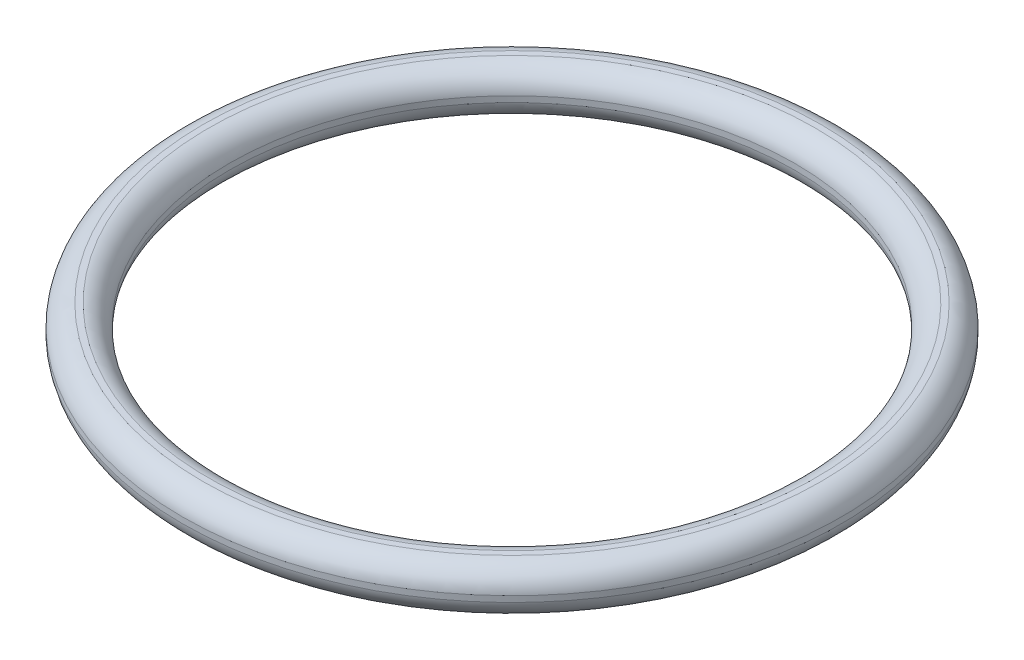
ISO-10303-21;
HEADER;
FILE_DESCRIPTION(('STEP AP214'),'2;1');
FILE_NAME('part.step','',(''),(''),'','','');
FILE_SCHEMA(('AUTOMOTIVE_DESIGN { 1 0 10303 214 1 1 1 1 }'));
ENDSEC;
DATA;
#1=APPLICATION_CONTEXT('core data for automotive mechanical design processes');
#2=APPLICATION_PROTOCOL_DEFINITION('international standard','automotive_design',2000,#1);
#3=PRODUCT_CONTEXT('',#1,'mechanical');
#4=PRODUCT('Part','Part','',(#3));
#5=PRODUCT_RELATED_PRODUCT_CATEGORY('part','',(#4));
#6=PRODUCT_DEFINITION_FORMATION('','',#4);
#7=PRODUCT_DEFINITION_CONTEXT('part definition',#1,'design');
#8=PRODUCT_DEFINITION('design','',#6,#7);
#9=PRODUCT_DEFINITION_SHAPE('','',#8);
#10=(LENGTH_UNIT() NAMED_UNIT(*) SI_UNIT(.MILLI.,.METRE.));
#11=(NAMED_UNIT(*) PLANE_ANGLE_UNIT() SI_UNIT($,.RADIAN.));
#12=(NAMED_UNIT(*) SI_UNIT($,.STERADIAN.) SOLID_ANGLE_UNIT());
#13=UNCERTAINTY_MEASURE_WITH_UNIT(LENGTH_MEASURE(1.E-05),#10,'distance_accuracy_value','');
#14=(GEOMETRIC_REPRESENTATION_CONTEXT(3) GLOBAL_UNCERTAINTY_ASSIGNED_CONTEXT((#13)) GLOBAL_UNIT_ASSIGNED_CONTEXT((#10,
#11,#12)) REPRESENTATION_CONTEXT('',''));
#15=CARTESIAN_POINT('',(0.,0.,0.));
#16=DIRECTION('',(0.,0.,1.));
#17=DIRECTION('',(1.,0.,0.));
#18=AXIS2_PLACEMENT_3D('',#15,#16,#17);
#19=CARTESIAN_POINT('',(0.,0.,0.));
#20=DIRECTION('',(0.,-1.,0.));
#21=DIRECTION('',(0.,0.,-1.));
#22=AXIS2_PLACEMENT_3D('',#19,#20,#21);
#23=TOROIDAL_SURFACE('',#22,41.275,3.175);
#24=CARTESIAN_POINT('',(0.,-3.15000000000001,0.));
#25=DIRECTION('',(0.,1.,0.));
#26=DIRECTION('',(0.,0.,1.));
#27=AXIS2_PLACEMENT_3D('',#24,#25,#26);
#28=CIRCLE('',#27,40.8773506569853);
#29=CARTESIAN_POINT('',(0.,-3.15000000000001,40.8773506569853));
#30=VERTEX_POINT('',#29);
#31=EDGE_CURVE('E50',#30,#30,#28,.T.);
#32=ORIENTED_EDGE('',*,*,#31,.F.);
#33=EDGE_LOOP('',(#32));
#34=FACE_BOUND('',#33,.T.);
#35=CARTESIAN_POINT('',(0.,-0.397649343014659,0.));
#36=DIRECTION('',(0.,1.,0.));
#37=DIRECTION('',(0.,0.,1.));
#38=AXIS2_PLACEMENT_3D('',#35,#36,#37);
#39=CIRCLE('',#38,38.125);
#40=CARTESIAN_POINT('',(0.,-0.397649343014659,38.125));
#41=VERTEX_POINT('',#40);
#42=EDGE_CURVE('E46',#41,#41,#39,.F.);
#43=ORIENTED_EDGE('',*,*,#42,.F.);
#44=EDGE_LOOP('',(#43));
#45=FACE_BOUND('',#44,.T.);
#46=ADVANCED_FACE('F42',(#34,#45),#23,.T.);
#47=CARTESIAN_POINT('',(0.,3.15,0.));
#48=DIRECTION('',(0.,-1.,0.));
#49=DIRECTION('',(0.,0.,-1.));
#50=AXIS2_PLACEMENT_3D('',#47,#48,#49);
#51=CIRCLE('',#50,40.8773506569853);
#52=CARTESIAN_POINT('',(0.,3.15,-40.8773506569853));
#53=VERTEX_POINT('',#52);
#54=EDGE_CURVE('E64',#53,#53,#51,.T.);
#55=ORIENTED_EDGE('',*,*,#54,.F.);
#56=EDGE_LOOP('',(#55));
#57=FACE_BOUND('',#56,.T.);
#58=CARTESIAN_POINT('',(0.,0.397649343014649,0.));
#59=DIRECTION('',(0.,-1.,0.));
#60=DIRECTION('',(0.,0.,-1.));
#61=AXIS2_PLACEMENT_3D('',#58,#59,#60);
#62=CIRCLE('',#61,38.125);
#63=CARTESIAN_POINT('',(0.,0.397649343014649,-38.125));
#64=VERTEX_POINT('',#63);
#65=EDGE_CURVE('E65',#64,#64,#62,.F.);
#66=ORIENTED_EDGE('',*,*,#65,.F.);
#67=EDGE_LOOP('',(#66));
#68=FACE_BOUND('',#67,.T.);
#69=ADVANCED_FACE('F75',(#57,#68),#23,.T.);
#70=CARTESIAN_POINT('',(0.,-0.397649343014659,0.));
#71=DIRECTION('',(0.,1.,0.));
#72=DIRECTION('',(0.,0.,1.));
#73=AXIS2_PLACEMENT_3D('',#70,#71,#72);
#74=CIRCLE('',#73,44.425);
#75=CARTESIAN_POINT('',(0.,-0.397649343014659,44.425));
#76=VERTEX_POINT('',#75);
#77=EDGE_CURVE('E62',#76,#76,#74,.F.);
#78=ORIENTED_EDGE('',*,*,#77,.T.);
#79=EDGE_LOOP('',(#78));
#80=FACE_BOUND('',#79,.T.);
#81=CARTESIAN_POINT('',(0.,-3.15000000000001,0.));
#82=DIRECTION('',(0.,-1.,0.));
#83=DIRECTION('',(0.,0.,-1.));
#84=AXIS2_PLACEMENT_3D('',#81,#82,#83);
#85=CIRCLE('',#84,41.6726493430146);
#86=CARTESIAN_POINT('',(0.,-3.15000000000001,-41.6726493430146));
#87=VERTEX_POINT('',#86);
#88=EDGE_CURVE('E10',#87,#87,#85,.T.);
#89=ORIENTED_EDGE('',*,*,#88,.F.);
#90=EDGE_LOOP('',(#89));
#91=FACE_BOUND('',#90,.T.);
#92=ADVANCED_FACE('F80',(#80,#91),#23,.T.);
#93=CARTESIAN_POINT('',(0.,3.15,0.));
#94=DIRECTION('',(0.,1.,0.));
#95=DIRECTION('',(0.,0.,1.));
#96=AXIS2_PLACEMENT_3D('',#93,#94,#95);
#97=PLANE('',#96);
#98=ORIENTED_EDGE('',*,*,#54,.T.);
#99=EDGE_LOOP('',(#98));
#100=FACE_BOUND('',#99,.T.);
#101=CARTESIAN_POINT('',(0.,3.15,0.));
#102=DIRECTION('',(0.,1.,0.));
#103=DIRECTION('',(0.,0.,1.));
#104=AXIS2_PLACEMENT_3D('',#101,#102,#103);
#105=CIRCLE('',#104,41.6726493430146);
#106=CARTESIAN_POINT('',(0.,3.15,41.6726493430146));
#107=VERTEX_POINT('',#106);
#108=EDGE_CURVE('E55',#107,#107,#105,.T.);
#109=ORIENTED_EDGE('',*,*,#108,.T.);
#110=EDGE_LOOP('',(#109));
#111=FACE_BOUND('',#110,.T.);
#112=ADVANCED_FACE('F85',(#100,#111),#97,.T.);
#113=CARTESIAN_POINT('',(0.,0.397649343014649,0.));
#114=DIRECTION('',(0.,-1.,0.));
#115=DIRECTION('',(0.,0.,-1.));
#116=AXIS2_PLACEMENT_3D('',#113,#114,#115);
#117=CIRCLE('',#116,44.425);
#118=CARTESIAN_POINT('',(0.,0.397649343014649,-44.425));
#119=VERTEX_POINT('',#118);
#120=EDGE_CURVE('E59',#119,#119,#117,.F.);
#121=ORIENTED_EDGE('',*,*,#120,.T.);
#122=EDGE_LOOP('',(#121));
#123=FACE_BOUND('',#122,.T.);
#124=ORIENTED_EDGE('',*,*,#108,.F.);
#125=EDGE_LOOP('',(#124));
#126=FACE_BOUND('',#125,.T.);
#127=ADVANCED_FACE('F44',(#123,#126),#23,.T.);
#128=CARTESIAN_POINT('',(0.,-3.15000000000001,0.));
#129=DIRECTION('',(0.,-1.,0.));
#130=DIRECTION('',(0.,0.,-1.));
#131=AXIS2_PLACEMENT_3D('',#128,#129,#130);
#132=PLANE('',#131);
#133=ORIENTED_EDGE('',*,*,#31,.T.);
#134=EDGE_LOOP('',(#133));
#135=FACE_BOUND('',#134,.T.);
#136=ORIENTED_EDGE('',*,*,#88,.T.);
#137=EDGE_LOOP('',(#136));
#138=FACE_BOUND('',#137,.T.);
#139=ADVANCED_FACE('F84',(#135,#138),#132,.T.);
#140=CARTESIAN_POINT('',(0.,-2.75,0.));
#141=DIRECTION('',(0.,-1.,0.));
#142=DIRECTION('',(0.,0.,-1.));
#143=AXIS2_PLACEMENT_3D('',#140,#141,#142);
#144=CYLINDRICAL_SURFACE('',#143,44.425);
#145=ORIENTED_EDGE('',*,*,#120,.F.);
#146=EDGE_LOOP('',(#145));
#147=FACE_BOUND('',#146,.T.);
#148=ORIENTED_EDGE('',*,*,#77,.F.);
#149=EDGE_LOOP('',(#148));
#150=FACE_BOUND('',#149,.T.);
#151=ADVANCED_FACE('F91',(#147,#150),#144,.T.);
#152=CARTESIAN_POINT('',(0.,-2.75,0.));
#153=DIRECTION('',(0.,-1.,0.));
#154=DIRECTION('',(0.,0.,-1.));
#155=AXIS2_PLACEMENT_3D('',#152,#153,#154);
#156=CYLINDRICAL_SURFACE('',#155,38.125);
#157=ORIENTED_EDGE('',*,*,#65,.T.);
#158=EDGE_LOOP('',(#157));
#159=FACE_BOUND('',#158,.T.);
#160=ORIENTED_EDGE('',*,*,#42,.T.);
#161=EDGE_LOOP('',(#160));
#162=FACE_BOUND('',#161,.T.);
#163=ADVANCED_FACE('F72',(#159,#162),#156,.F.);
#164=CLOSED_SHELL('',(#46,#69,#92,#112,#127,#139,#151,#163));
#165=MANIFOLD_SOLID_BREP('B2',#164);
#166=ADVANCED_BREP_SHAPE_REPRESENTATION('',(#18,#165),#14);
#167=SHAPE_DEFINITION_REPRESENTATION(#9,#166);
ENDSEC;
END-ISO-10303-21;
